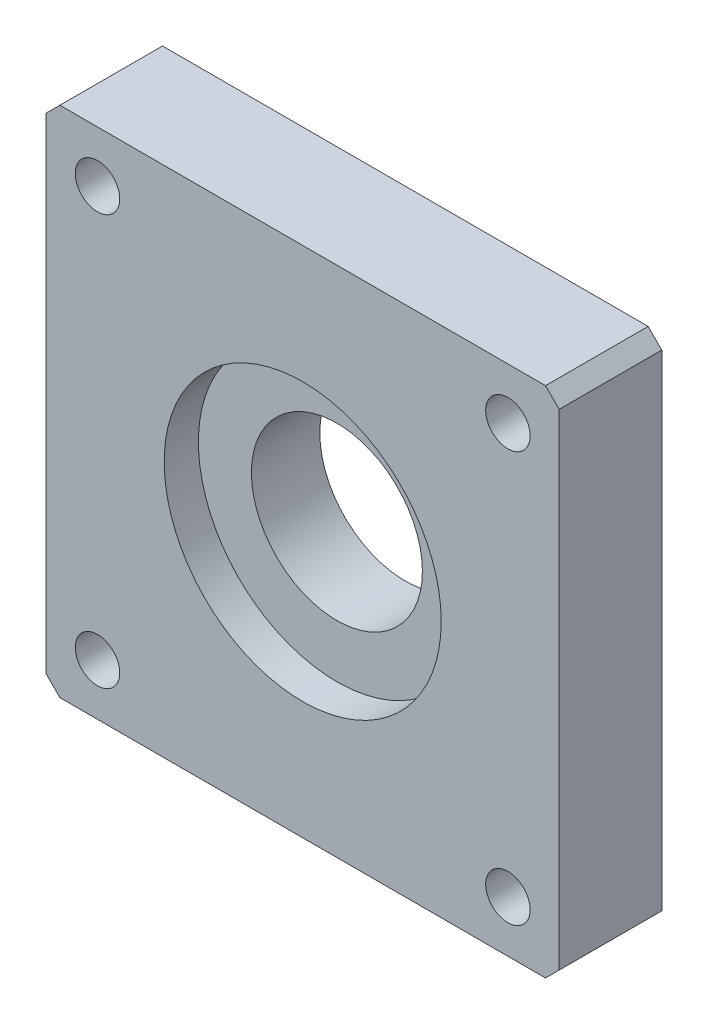
ISO-10303-21;
HEADER;
FILE_DESCRIPTION(('STEP AP214'),'2;1');
FILE_NAME('part.step','',(''),(''),'','','');
FILE_SCHEMA(('AUTOMOTIVE_DESIGN { 1 0 10303 214 1 1 1 1 }'));
ENDSEC;
DATA;
#1=APPLICATION_CONTEXT('core data for automotive mechanical design processes');
#2=APPLICATION_PROTOCOL_DEFINITION('international standard','automotive_design',2000,#1);
#3=PRODUCT_CONTEXT('',#1,'mechanical');
#4=PRODUCT('Part','Part','',(#3));
#5=PRODUCT_RELATED_PRODUCT_CATEGORY('part','',(#4));
#6=PRODUCT_DEFINITION_FORMATION('','',#4);
#7=PRODUCT_DEFINITION_CONTEXT('part definition',#1,'design');
#8=PRODUCT_DEFINITION('design','',#6,#7);
#9=PRODUCT_DEFINITION_SHAPE('','',#8);
#10=(LENGTH_UNIT() NAMED_UNIT(*) SI_UNIT(.MILLI.,.METRE.));
#11=(NAMED_UNIT(*) PLANE_ANGLE_UNIT() SI_UNIT($,.RADIAN.));
#12=(NAMED_UNIT(*) SI_UNIT($,.STERADIAN.) SOLID_ANGLE_UNIT());
#13=UNCERTAINTY_MEASURE_WITH_UNIT(LENGTH_MEASURE(1.E-05),#10,'distance_accuracy_value','');
#14=(GEOMETRIC_REPRESENTATION_CONTEXT(3) GLOBAL_UNCERTAINTY_ASSIGNED_CONTEXT((#13)) GLOBAL_UNIT_ASSIGNED_CONTEXT((#10,
#11,#12)) REPRESENTATION_CONTEXT('',''));
#15=CARTESIAN_POINT('',(0.,0.,0.));
#16=DIRECTION('',(0.,0.,1.));
#17=DIRECTION('',(1.,0.,0.));
#18=AXIS2_PLACEMENT_3D('',#15,#16,#17);
#19=CARTESIAN_POINT('',(37.5,-37.5,0.));
#20=DIRECTION('',(0.,0.,1.));
#21=DIRECTION('',(1.,0.,0.));
#22=AXIS2_PLACEMENT_3D('',#19,#20,#21);
#23=CYLINDRICAL_SURFACE('',#22,12.5);
#24=CARTESIAN_POINT('',(37.5,-37.5,0.));
#25=DIRECTION('',(0.,0.,1.));
#26=DIRECTION('',(1.,0.,0.));
#27=AXIS2_PLACEMENT_3D('',#24,#25,#26);
#28=CIRCLE('',#27,12.5);
#29=CARTESIAN_POINT('',(50.,-37.5,0.));
#30=VERTEX_POINT('',#29);
#31=EDGE_CURVE('E170',#30,#30,#28,.T.);
#32=ORIENTED_EDGE('',*,*,#31,.F.);
#33=EDGE_LOOP('',(#32));
#34=FACE_BOUND('',#33,.T.);
#35=CARTESIAN_POINT('',(37.5,-37.5,10.));
#36=DIRECTION('',(0.,0.,1.));
#37=DIRECTION('',(1.,0.,0.));
#38=AXIS2_PLACEMENT_3D('',#35,#36,#37);
#39=CIRCLE('',#38,12.5);
#40=CARTESIAN_POINT('',(50.,-37.5,10.));
#41=VERTEX_POINT('',#40);
#42=EDGE_CURVE('E42',#41,#41,#39,.F.);
#43=ORIENTED_EDGE('',*,*,#42,.F.);
#44=EDGE_LOOP('',(#43));
#45=FACE_BOUND('',#44,.T.);
#46=ADVANCED_FACE('F37',(#34,#45),#23,.F.);
#47=CARTESIAN_POINT('',(0.,0.,15.));
#48=DIRECTION('',(1.,0.,0.));
#49=DIRECTION('',(0.,1.,0.));
#50=AXIS2_PLACEMENT_3D('',#47,#48,#49);
#51=PLANE('',#50);
#52=DIRECTION('',(0.,-1.,0.));
#53=VECTOR('',#52,1.);
#54=CARTESIAN_POINT('',(0.,0.,0.));
#55=LINE('',#54,#53);
#56=CARTESIAN_POINT('',(0.,-2.,0.));
#57=VERTEX_POINT('',#56);
#58=CARTESIAN_POINT('',(0.,-73.,0.));
#59=VERTEX_POINT('',#58);
#60=EDGE_CURVE('E135',#57,#59,#55,.T.);
#61=ORIENTED_EDGE('',*,*,#60,.T.);
#62=DIRECTION('',(0.,0.,1.));
#63=VECTOR('',#62,1.);
#64=CARTESIAN_POINT('',(0.,-73.,15.));
#65=LINE('',#64,#63);
#66=CARTESIAN_POINT('',(0.,-73.,15.));
#67=VERTEX_POINT('',#66);
#68=EDGE_CURVE('E11',#59,#67,#65,.T.);
#69=ORIENTED_EDGE('',*,*,#68,.T.);
#70=DIRECTION('',(0.,-1.,0.));
#71=VECTOR('',#70,1.);
#72=CARTESIAN_POINT('',(0.,0.,15.));
#73=LINE('',#72,#71);
#74=CARTESIAN_POINT('',(0.,-2.,15.));
#75=VERTEX_POINT('',#74);
#76=EDGE_CURVE('E133',#75,#67,#73,.T.);
#77=ORIENTED_EDGE('',*,*,#76,.F.);
#78=DIRECTION('',(0.,0.,-1.));
#79=VECTOR('',#78,1.);
#80=CARTESIAN_POINT('',(0.,-2.,15.));
#81=LINE('',#80,#79);
#82=EDGE_CURVE('E47',#75,#57,#81,.T.);
#83=ORIENTED_EDGE('',*,*,#82,.T.);
#84=EDGE_LOOP('',(#61,#69,#77,#83));
#85=FACE_BOUND('',#84,.T.);
#86=ADVANCED_FACE('F165',(#85),#51,.F.);
#87=CARTESIAN_POINT('',(0.,-75.,15.));
#88=DIRECTION('',(0.,1.,0.));
#89=DIRECTION('',(0.,0.,1.));
#90=AXIS2_PLACEMENT_3D('',#87,#88,#89);
#91=PLANE('',#90);
#92=DIRECTION('',(1.,0.,0.));
#93=VECTOR('',#92,1.);
#94=CARTESIAN_POINT('',(0.,-75.,0.));
#95=LINE('',#94,#93);
#96=CARTESIAN_POINT('',(2.00000000000001,-75.,0.));
#97=VERTEX_POINT('',#96);
#98=CARTESIAN_POINT('',(73.,-75.,0.));
#99=VERTEX_POINT('',#98);
#100=EDGE_CURVE('E131',#97,#99,#95,.T.);
#101=ORIENTED_EDGE('',*,*,#100,.T.);
#102=DIRECTION('',(0.,0.,1.));
#103=VECTOR('',#102,1.);
#104=CARTESIAN_POINT('',(73.,-75.,15.));
#105=LINE('',#104,#103);
#106=CARTESIAN_POINT('',(73.,-75.,15.));
#107=VERTEX_POINT('',#106);
#108=EDGE_CURVE('E110',#99,#107,#105,.T.);
#109=ORIENTED_EDGE('',*,*,#108,.T.);
#110=DIRECTION('',(1.,0.,0.));
#111=VECTOR('',#110,1.);
#112=CARTESIAN_POINT('',(0.,-75.,15.));
#113=LINE('',#112,#111);
#114=CARTESIAN_POINT('',(2.00000000000001,-75.,15.));
#115=VERTEX_POINT('',#114);
#116=EDGE_CURVE('E177',#115,#107,#113,.T.);
#117=ORIENTED_EDGE('',*,*,#116,.F.);
#118=DIRECTION('',(0.,0.,-1.));
#119=VECTOR('',#118,1.);
#120=CARTESIAN_POINT('',(2.00000000000001,-75.,15.));
#121=LINE('',#120,#119);
#122=EDGE_CURVE('E115',#115,#97,#121,.T.);
#123=ORIENTED_EDGE('',*,*,#122,.T.);
#124=EDGE_LOOP('',(#101,#109,#117,#123));
#125=FACE_BOUND('',#124,.T.);
#126=ADVANCED_FACE('F222',(#125),#91,.F.);
#127=CARTESIAN_POINT('',(75.,0.,15.));
#128=DIRECTION('',(-1.,0.,0.));
#129=DIRECTION('',(0.,0.,1.));
#130=AXIS2_PLACEMENT_3D('',#127,#128,#129);
#131=PLANE('',#130);
#132=DIRECTION('',(0.,1.,0.));
#133=VECTOR('',#132,1.);
#134=CARTESIAN_POINT('',(75.,0.,15.));
#135=LINE('',#134,#133);
#136=CARTESIAN_POINT('',(75.,-73.,15.));
#137=VERTEX_POINT('',#136);
#138=CARTESIAN_POINT('',(75.,-2.,15.));
#139=VERTEX_POINT('',#138);
#140=EDGE_CURVE('E124',#137,#139,#135,.T.);
#141=ORIENTED_EDGE('',*,*,#140,.F.);
#142=DIRECTION('',(0.,0.,-1.));
#143=VECTOR('',#142,1.);
#144=CARTESIAN_POINT('',(75.,-73.,15.));
#145=LINE('',#144,#143);
#146=CARTESIAN_POINT('',(75.,-73.,0.));
#147=VERTEX_POINT('',#146);
#148=EDGE_CURVE('E109',#137,#147,#145,.T.);
#149=ORIENTED_EDGE('',*,*,#148,.T.);
#150=DIRECTION('',(0.,1.,0.));
#151=VECTOR('',#150,1.);
#152=CARTESIAN_POINT('',(75.,0.,0.));
#153=LINE('',#152,#151);
#154=CARTESIAN_POINT('',(75.,-2.,0.));
#155=VERTEX_POINT('',#154);
#156=EDGE_CURVE('E122',#147,#155,#153,.T.);
#157=ORIENTED_EDGE('',*,*,#156,.T.);
#158=DIRECTION('',(0.,0.,1.));
#159=VECTOR('',#158,1.);
#160=CARTESIAN_POINT('',(75.,-2.,15.));
#161=LINE('',#160,#159);
#162=EDGE_CURVE('E126',#155,#139,#161,.T.);
#163=ORIENTED_EDGE('',*,*,#162,.T.);
#164=EDGE_LOOP('',(#141,#149,#157,#163));
#165=FACE_BOUND('',#164,.T.);
#166=ADVANCED_FACE('F121',(#165),#131,.F.);
#167=CARTESIAN_POINT('',(0.,0.,15.));
#168=DIRECTION('',(0.,-1.,0.));
#169=DIRECTION('',(0.,0.,-1.));
#170=AXIS2_PLACEMENT_3D('',#167,#168,#169);
#171=PLANE('',#170);
#172=DIRECTION('',(-1.,0.,0.));
#173=VECTOR('',#172,1.);
#174=CARTESIAN_POINT('',(0.,0.,15.));
#175=LINE('',#174,#173);
#176=CARTESIAN_POINT('',(73.,0.,15.));
#177=VERTEX_POINT('',#176);
#178=CARTESIAN_POINT('',(2.,0.,15.));
#179=VERTEX_POINT('',#178);
#180=EDGE_CURVE('E139',#177,#179,#175,.T.);
#181=ORIENTED_EDGE('',*,*,#180,.F.);
#182=DIRECTION('',(0.,0.,-1.));
#183=VECTOR('',#182,1.);
#184=CARTESIAN_POINT('',(73.,0.,15.));
#185=LINE('',#184,#183);
#186=CARTESIAN_POINT('',(73.,0.,0.));
#187=VERTEX_POINT('',#186);
#188=EDGE_CURVE('E156',#177,#187,#185,.T.);
#189=ORIENTED_EDGE('',*,*,#188,.T.);
#190=DIRECTION('',(-1.,0.,0.));
#191=VECTOR('',#190,1.);
#192=CARTESIAN_POINT('',(0.,0.,0.));
#193=LINE('',#192,#191);
#194=CARTESIAN_POINT('',(2.,0.,0.));
#195=VERTEX_POINT('',#194);
#196=EDGE_CURVE('E130',#187,#195,#193,.T.);
#197=ORIENTED_EDGE('',*,*,#196,.T.);
#198=DIRECTION('',(0.,0.,1.));
#199=VECTOR('',#198,1.);
#200=CARTESIAN_POINT('',(2.,0.,15.));
#201=LINE('',#200,#199);
#202=EDGE_CURVE('E54',#195,#179,#201,.T.);
#203=ORIENTED_EDGE('',*,*,#202,.T.);
#204=EDGE_LOOP('',(#181,#189,#197,#203));
#205=FACE_BOUND('',#204,.T.);
#206=ADVANCED_FACE('F232',(#205),#171,.F.);
#207=CARTESIAN_POINT('',(0.,0.,15.));
#208=DIRECTION('',(0.,0.,1.));
#209=DIRECTION('',(1.,0.,0.));
#210=AXIS2_PLACEMENT_3D('',#207,#208,#209);
#211=PLANE('',#210);
#212=CARTESIAN_POINT('',(37.5,-37.5,15.));
#213=DIRECTION('',(0.,0.,1.));
#214=DIRECTION('',(1.,0.,0.));
#215=AXIS2_PLACEMENT_3D('',#212,#213,#214);
#216=CIRCLE('',#215,20.25);
#217=CARTESIAN_POINT('',(57.75,-37.5,15.));
#218=VERTEX_POINT('',#217);
#219=EDGE_CURVE('E204',#218,#218,#216,.T.);
#220=ORIENTED_EDGE('',*,*,#219,.F.);
#221=EDGE_LOOP('',(#220));
#222=FACE_BOUND('',#221,.T.);
#223=CARTESIAN_POINT('',(7.49999999999998,-67.5,15.));
#224=DIRECTION('',(0.,0.,1.));
#225=DIRECTION('',(-1.,0.,0.));
#226=AXIS2_PLACEMENT_3D('',#223,#224,#225);
#227=CIRCLE('',#226,3.25);
#228=CARTESIAN_POINT('',(4.24999999999998,-67.5,15.));
#229=VERTEX_POINT('',#228);
#230=EDGE_CURVE('E181',#229,#229,#227,.T.);
#231=ORIENTED_EDGE('',*,*,#230,.F.);
#232=EDGE_LOOP('',(#231));
#233=FACE_BOUND('',#232,.T.);
#234=CARTESIAN_POINT('',(67.5,-67.5,15.));
#235=DIRECTION('',(0.,0.,1.));
#236=DIRECTION('',(1.,0.,0.));
#237=AXIS2_PLACEMENT_3D('',#234,#235,#236);
#238=CIRCLE('',#237,3.25);
#239=CARTESIAN_POINT('',(70.75,-67.5,15.));
#240=VERTEX_POINT('',#239);
#241=EDGE_CURVE('E187',#240,#240,#238,.T.);
#242=ORIENTED_EDGE('',*,*,#241,.F.);
#243=EDGE_LOOP('',(#242));
#244=FACE_BOUND('',#243,.T.);
#245=CARTESIAN_POINT('',(67.5,-7.50000000000002,15.));
#246=DIRECTION('',(0.,0.,1.));
#247=DIRECTION('',(-1.,0.,0.));
#248=AXIS2_PLACEMENT_3D('',#245,#246,#247);
#249=CIRCLE('',#248,3.25000000000001);
#250=CARTESIAN_POINT('',(64.25,-7.50000000000002,15.));
#251=VERTEX_POINT('',#250);
#252=EDGE_CURVE('E193',#251,#251,#249,.T.);
#253=ORIENTED_EDGE('',*,*,#252,.F.);
#254=EDGE_LOOP('',(#253));
#255=FACE_BOUND('',#254,.T.);
#256=CARTESIAN_POINT('',(7.5,-7.50000000000001,15.));
#257=DIRECTION('',(0.,0.,1.));
#258=DIRECTION('',(1.,0.,0.));
#259=AXIS2_PLACEMENT_3D('',#256,#257,#258);
#260=CIRCLE('',#259,3.25);
#261=CARTESIAN_POINT('',(10.75,-7.50000000000001,15.));
#262=VERTEX_POINT('',#261);
#263=EDGE_CURVE('E199',#262,#262,#260,.T.);
#264=ORIENTED_EDGE('',*,*,#263,.F.);
#265=EDGE_LOOP('',(#264));
#266=FACE_BOUND('',#265,.T.);
#267=ORIENTED_EDGE('',*,*,#116,.T.);
#268=DIRECTION('',(-0.707106781186552,-0.707106781186543,0.));
#269=VECTOR('',#268,1.);
#270=CARTESIAN_POINT('',(73.9999999999995,-74.0000000000005,15.));
#271=LINE('',#270,#269);
#272=EDGE_CURVE('E153',#107,#137,#271,.F.);
#273=ORIENTED_EDGE('',*,*,#272,.T.);
#274=ORIENTED_EDGE('',*,*,#140,.T.);
#275=DIRECTION('',(0.707106781186543,-0.707106781186552,0.));
#276=VECTOR('',#275,1.);
#277=CARTESIAN_POINT('',(36.5000000000005,36.5,15.));
#278=LINE('',#277,#276);
#279=EDGE_CURVE('E61',#139,#177,#278,.F.);
#280=ORIENTED_EDGE('',*,*,#279,.T.);
#281=ORIENTED_EDGE('',*,*,#180,.T.);
#282=DIRECTION('',(0.707106781186548,0.707106781186548,0.));
#283=VECTOR('',#282,1.);
#284=CARTESIAN_POINT('',(1.,-1.,15.));
#285=LINE('',#284,#283);
#286=EDGE_CURVE('E148',#179,#75,#285,.F.);
#287=ORIENTED_EDGE('',*,*,#286,.T.);
#288=ORIENTED_EDGE('',*,*,#76,.T.);
#289=DIRECTION('',(-0.707106781186545,0.70710678118655,0.));
#290=VECTOR('',#289,1.);
#291=CARTESIAN_POINT('',(-36.5,-36.4999999999997,15.));
#292=LINE('',#291,#290);
#293=EDGE_CURVE('E150',#67,#115,#292,.F.);
#294=ORIENTED_EDGE('',*,*,#293,.T.);
#295=EDGE_LOOP('',(#267,#273,#274,#280,#281,#287,#288,#294));
#296=FACE_BOUND('',#295,.T.);
#297=ADVANCED_FACE('F229',(#222,#233,#244,#255,#266,#296),#211,.T.);
#298=CARTESIAN_POINT('',(0.,0.,0.));
#299=DIRECTION('',(0.,0.,1.));
#300=DIRECTION('',(1.,0.,0.));
#301=AXIS2_PLACEMENT_3D('',#298,#299,#300);
#302=PLANE('',#301);
#303=CARTESIAN_POINT('',(7.49999999999998,-67.5,0.));
#304=DIRECTION('',(0.,0.,1.));
#305=DIRECTION('',(-1.,0.,0.));
#306=AXIS2_PLACEMENT_3D('',#303,#304,#305);
#307=CIRCLE('',#306,3.25);
#308=CARTESIAN_POINT('',(4.24999999999998,-67.5,0.));
#309=VERTEX_POINT('',#308);
#310=EDGE_CURVE('E184',#309,#309,#307,.T.);
#311=ORIENTED_EDGE('',*,*,#310,.T.);
#312=EDGE_LOOP('',(#311));
#313=FACE_BOUND('',#312,.T.);
#314=CARTESIAN_POINT('',(67.5,-67.5,0.));
#315=DIRECTION('',(0.,0.,1.));
#316=DIRECTION('',(1.,0.,0.));
#317=AXIS2_PLACEMENT_3D('',#314,#315,#316);
#318=CIRCLE('',#317,3.25);
#319=CARTESIAN_POINT('',(70.75,-67.5,0.));
#320=VERTEX_POINT('',#319);
#321=EDGE_CURVE('E190',#320,#320,#318,.T.);
#322=ORIENTED_EDGE('',*,*,#321,.T.);
#323=EDGE_LOOP('',(#322));
#324=FACE_BOUND('',#323,.T.);
#325=CARTESIAN_POINT('',(67.5,-7.50000000000002,0.));
#326=DIRECTION('',(0.,0.,1.));
#327=DIRECTION('',(-1.,0.,0.));
#328=AXIS2_PLACEMENT_3D('',#325,#326,#327);
#329=CIRCLE('',#328,3.25000000000001);
#330=CARTESIAN_POINT('',(64.25,-7.50000000000002,0.));
#331=VERTEX_POINT('',#330);
#332=EDGE_CURVE('E196',#331,#331,#329,.T.);
#333=ORIENTED_EDGE('',*,*,#332,.T.);
#334=EDGE_LOOP('',(#333));
#335=FACE_BOUND('',#334,.T.);
#336=CARTESIAN_POINT('',(7.5,-7.50000000000001,0.));
#337=DIRECTION('',(0.,0.,1.));
#338=DIRECTION('',(1.,0.,0.));
#339=AXIS2_PLACEMENT_3D('',#336,#337,#338);
#340=CIRCLE('',#339,3.25);
#341=CARTESIAN_POINT('',(10.75,-7.50000000000001,0.));
#342=VERTEX_POINT('',#341);
#343=EDGE_CURVE('E172',#342,#342,#340,.T.);
#344=ORIENTED_EDGE('',*,*,#343,.T.);
#345=EDGE_LOOP('',(#344));
#346=FACE_BOUND('',#345,.T.);
#347=ORIENTED_EDGE('',*,*,#31,.T.);
#348=EDGE_LOOP('',(#347));
#349=FACE_BOUND('',#348,.T.);
#350=ORIENTED_EDGE('',*,*,#156,.F.);
#351=DIRECTION('',(0.707106781186552,0.707106781186543,0.));
#352=VECTOR('',#351,1.);
#353=CARTESIAN_POINT('',(75.,-73.,0.));
#354=LINE('',#353,#352);
#355=EDGE_CURVE('E105',#147,#99,#354,.F.);
#356=ORIENTED_EDGE('',*,*,#355,.T.);
#357=ORIENTED_EDGE('',*,*,#100,.F.);
#358=DIRECTION('',(0.707106781186545,-0.70710678118655,0.));
#359=VECTOR('',#358,1.);
#360=CARTESIAN_POINT('',(2.00000000000001,-75.,0.));
#361=LINE('',#360,#359);
#362=EDGE_CURVE('E142',#97,#59,#361,.F.);
#363=ORIENTED_EDGE('',*,*,#362,.T.);
#364=ORIENTED_EDGE('',*,*,#60,.F.);
#365=DIRECTION('',(-0.707106781186548,-0.707106781186548,0.));
#366=VECTOR('',#365,1.);
#367=CARTESIAN_POINT('',(0.,-2.,0.));
#368=LINE('',#367,#366);
#369=EDGE_CURVE('E125',#57,#195,#368,.F.);
#370=ORIENTED_EDGE('',*,*,#369,.T.);
#371=ORIENTED_EDGE('',*,*,#196,.F.);
#372=DIRECTION('',(-0.707106781186543,0.707106781186552,0.));
#373=VECTOR('',#372,1.);
#374=CARTESIAN_POINT('',(73.,0.,0.));
#375=LINE('',#374,#373);
#376=EDGE_CURVE('E116',#187,#155,#375,.F.);
#377=ORIENTED_EDGE('',*,*,#376,.T.);
#378=EDGE_LOOP('',(#350,#356,#357,#363,#364,#370,#371,#377));
#379=FACE_BOUND('',#378,.T.);
#380=ADVANCED_FACE('F128',(#313,#324,#335,#346,#349,#379),#302,.F.);
#381=CARTESIAN_POINT('',(75.,-73.,15.));
#382=DIRECTION('',(-0.707106781186543,0.707106781186552,0.));
#383=DIRECTION('',(0.,0.,-1.));
#384=AXIS2_PLACEMENT_3D('',#381,#382,#383);
#385=PLANE('',#384);
#386=ORIENTED_EDGE('',*,*,#272,.F.);
#387=ORIENTED_EDGE('',*,*,#108,.F.);
#388=ORIENTED_EDGE('',*,*,#355,.F.);
#389=ORIENTED_EDGE('',*,*,#148,.F.);
#390=EDGE_LOOP('',(#386,#387,#388,#389));
#391=FACE_BOUND('',#390,.T.);
#392=ADVANCED_FACE('F108',(#391),#385,.F.);
#393=CARTESIAN_POINT('',(73.,0.,15.));
#394=DIRECTION('',(-0.707106781186552,-0.707106781186543,0.));
#395=DIRECTION('',(0.,0.,-1.));
#396=AXIS2_PLACEMENT_3D('',#393,#394,#395);
#397=PLANE('',#396);
#398=ORIENTED_EDGE('',*,*,#279,.F.);
#399=ORIENTED_EDGE('',*,*,#162,.F.);
#400=ORIENTED_EDGE('',*,*,#376,.F.);
#401=ORIENTED_EDGE('',*,*,#188,.F.);
#402=EDGE_LOOP('',(#398,#399,#400,#401));
#403=FACE_BOUND('',#402,.T.);
#404=ADVANCED_FACE('F250',(#403),#397,.F.);
#405=CARTESIAN_POINT('',(2.00000000000001,-75.,15.));
#406=DIRECTION('',(0.70710678118655,0.707106781186545,0.));
#407=DIRECTION('',(0.,0.,-1.));
#408=AXIS2_PLACEMENT_3D('',#405,#406,#407);
#409=PLANE('',#408);
#410=ORIENTED_EDGE('',*,*,#293,.F.);
#411=ORIENTED_EDGE('',*,*,#68,.F.);
#412=ORIENTED_EDGE('',*,*,#362,.F.);
#413=ORIENTED_EDGE('',*,*,#122,.F.);
#414=EDGE_LOOP('',(#410,#411,#412,#413));
#415=FACE_BOUND('',#414,.T.);
#416=ADVANCED_FACE('F255',(#415),#409,.F.);
#417=CARTESIAN_POINT('',(0.,-2.,15.));
#418=DIRECTION('',(0.707106781186547,-0.707106781186547,0.));
#419=DIRECTION('',(0.,0.,-1.));
#420=AXIS2_PLACEMENT_3D('',#417,#418,#419);
#421=PLANE('',#420);
#422=ORIENTED_EDGE('',*,*,#286,.F.);
#423=ORIENTED_EDGE('',*,*,#202,.F.);
#424=ORIENTED_EDGE('',*,*,#369,.F.);
#425=ORIENTED_EDGE('',*,*,#82,.F.);
#426=EDGE_LOOP('',(#422,#423,#424,#425));
#427=FACE_BOUND('',#426,.T.);
#428=ADVANCED_FACE('F40',(#427),#421,.F.);
#429=CARTESIAN_POINT('',(7.5,-7.50000000000001,0.));
#430=DIRECTION('',(0.,0.,1.));
#431=DIRECTION('',(1.,0.,0.));
#432=AXIS2_PLACEMENT_3D('',#429,#430,#431);
#433=CYLINDRICAL_SURFACE('',#432,3.25);
#434=ORIENTED_EDGE('',*,*,#343,.F.);
#435=EDGE_LOOP('',(#434));
#436=FACE_BOUND('',#435,.T.);
#437=ORIENTED_EDGE('',*,*,#263,.T.);
#438=EDGE_LOOP('',(#437));
#439=FACE_BOUND('',#438,.T.);
#440=ADVANCED_FACE('F264',(#436,#439),#433,.F.);
#441=CARTESIAN_POINT('',(67.5,-7.50000000000002,0.));
#442=DIRECTION('',(0.,0.,1.));
#443=DIRECTION('',(1.,0.,0.));
#444=AXIS2_PLACEMENT_3D('',#441,#442,#443);
#445=CYLINDRICAL_SURFACE('',#444,3.25000000000001);
#446=ORIENTED_EDGE('',*,*,#332,.F.);
#447=EDGE_LOOP('',(#446));
#448=FACE_BOUND('',#447,.T.);
#449=ORIENTED_EDGE('',*,*,#252,.T.);
#450=EDGE_LOOP('',(#449));
#451=FACE_BOUND('',#450,.T.);
#452=ADVANCED_FACE('F272',(#448,#451),#445,.F.);
#453=CARTESIAN_POINT('',(67.5,-67.5,0.));
#454=DIRECTION('',(0.,0.,1.));
#455=DIRECTION('',(1.,0.,0.));
#456=AXIS2_PLACEMENT_3D('',#453,#454,#455);
#457=CYLINDRICAL_SURFACE('',#456,3.25);
#458=ORIENTED_EDGE('',*,*,#321,.F.);
#459=EDGE_LOOP('',(#458));
#460=FACE_BOUND('',#459,.T.);
#461=ORIENTED_EDGE('',*,*,#241,.T.);
#462=EDGE_LOOP('',(#461));
#463=FACE_BOUND('',#462,.T.);
#464=ADVANCED_FACE('F278',(#460,#463),#457,.F.);
#465=CARTESIAN_POINT('',(7.49999999999998,-67.5,0.));
#466=DIRECTION('',(0.,0.,1.));
#467=DIRECTION('',(1.,0.,0.));
#468=AXIS2_PLACEMENT_3D('',#465,#466,#467);
#469=CYLINDRICAL_SURFACE('',#468,3.25);
#470=ORIENTED_EDGE('',*,*,#310,.F.);
#471=EDGE_LOOP('',(#470));
#472=FACE_BOUND('',#471,.T.);
#473=ORIENTED_EDGE('',*,*,#230,.T.);
#474=EDGE_LOOP('',(#473));
#475=FACE_BOUND('',#474,.T.);
#476=ADVANCED_FACE('F227',(#472,#475),#469,.F.);
#477=CARTESIAN_POINT('',(37.5,-37.5,10.));
#478=DIRECTION('',(0.,0.,1.));
#479=DIRECTION('',(1.,0.,0.));
#480=AXIS2_PLACEMENT_3D('',#477,#478,#479);
#481=PLANE('',#480);
#482=CARTESIAN_POINT('',(37.5,-37.5,10.));
#483=DIRECTION('',(0.,0.,1.));
#484=DIRECTION('',(1.,0.,0.));
#485=AXIS2_PLACEMENT_3D('',#482,#483,#484);
#486=CIRCLE('',#485,20.25);
#487=CARTESIAN_POINT('',(57.75,-37.5,10.));
#488=VERTEX_POINT('',#487);
#489=EDGE_CURVE('E207',#488,#488,#486,.T.);
#490=ORIENTED_EDGE('',*,*,#489,.T.);
#491=EDGE_LOOP('',(#490));
#492=FACE_BOUND('',#491,.T.);
#493=ORIENTED_EDGE('',*,*,#42,.T.);
#494=EDGE_LOOP('',(#493));
#495=FACE_BOUND('',#494,.T.);
#496=ADVANCED_FACE('F214',(#492,#495),#481,.T.);
#497=CARTESIAN_POINT('',(37.5,-37.5,10.));
#498=DIRECTION('',(0.,0.,1.));
#499=DIRECTION('',(1.,0.,0.));
#500=AXIS2_PLACEMENT_3D('',#497,#498,#499);
#501=CYLINDRICAL_SURFACE('',#500,20.25);
#502=ORIENTED_EDGE('',*,*,#489,.F.);
#503=EDGE_LOOP('',(#502));
#504=FACE_BOUND('',#503,.T.);
#505=ORIENTED_EDGE('',*,*,#219,.T.);
#506=EDGE_LOOP('',(#505));
#507=FACE_BOUND('',#506,.T.);
#508=ADVANCED_FACE('F284',(#504,#507),#501,.F.);
#509=CLOSED_SHELL('',(#46,#86,#126,#166,#206,#297,#380,#392,#404,#416,#428,#440,#452,#464,#476,
#496,#508));
#510=MANIFOLD_SOLID_BREP('B2',#509);
#511=ADVANCED_BREP_SHAPE_REPRESENTATION('',(#18,#510),#14);
#512=SHAPE_DEFINITION_REPRESENTATION(#9,#511);
ENDSEC;
END-ISO-10303-21;
